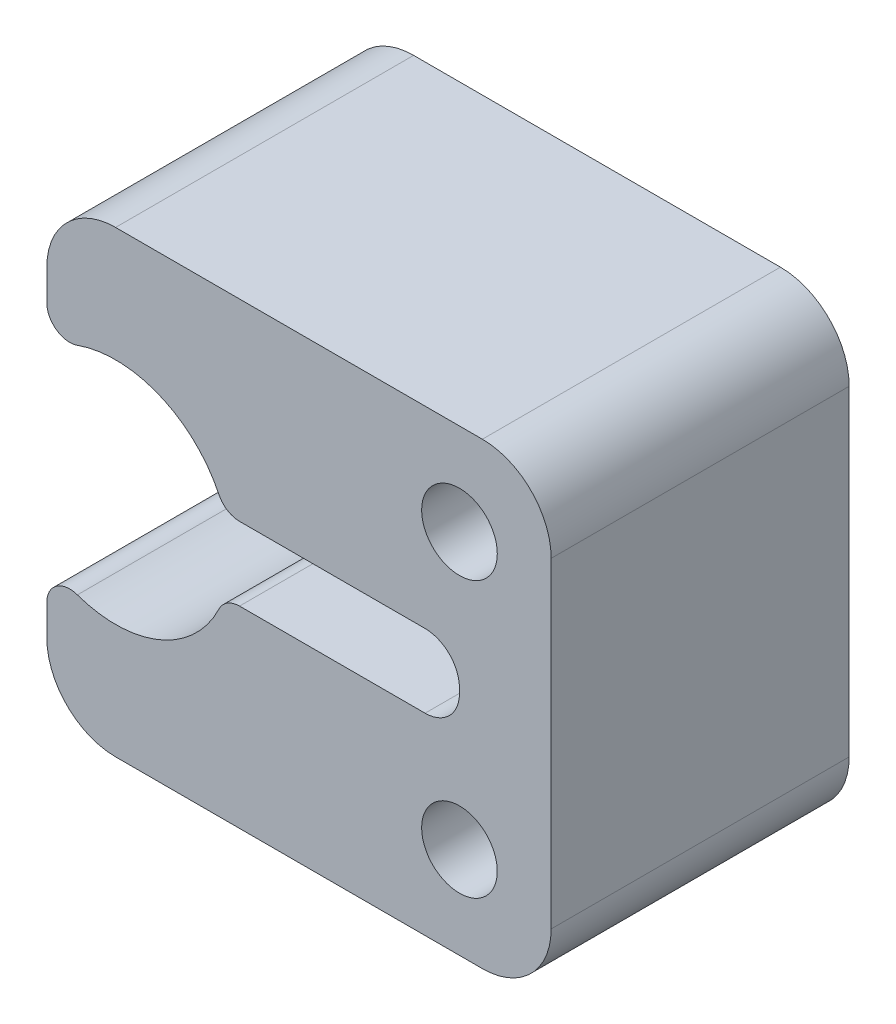
ISO-10303-21;
HEADER;
FILE_DESCRIPTION(('STEP AP214'),'2;1');
FILE_NAME('part.step','',(''),(''),'','','');
FILE_SCHEMA(('AUTOMOTIVE_DESIGN { 1 0 10303 214 1 1 1 1 }'));
ENDSEC;
DATA;
#1=APPLICATION_CONTEXT('core data for automotive mechanical design processes');
#2=APPLICATION_PROTOCOL_DEFINITION('international standard','automotive_design',2000,#1);
#3=PRODUCT_CONTEXT('',#1,'mechanical');
#4=PRODUCT('Part','Part','',(#3));
#5=PRODUCT_RELATED_PRODUCT_CATEGORY('part','',(#4));
#6=PRODUCT_DEFINITION_FORMATION('','',#4);
#7=PRODUCT_DEFINITION_CONTEXT('part definition',#1,'design');
#8=PRODUCT_DEFINITION('design','',#6,#7);
#9=PRODUCT_DEFINITION_SHAPE('','',#8);
#10=(LENGTH_UNIT() NAMED_UNIT(*) SI_UNIT(.MILLI.,.METRE.));
#11=(NAMED_UNIT(*) PLANE_ANGLE_UNIT() SI_UNIT($,.RADIAN.));
#12=(NAMED_UNIT(*) SI_UNIT($,.STERADIAN.) SOLID_ANGLE_UNIT());
#13=UNCERTAINTY_MEASURE_WITH_UNIT(LENGTH_MEASURE(1.E-05),#10,'distance_accuracy_value','');
#14=(GEOMETRIC_REPRESENTATION_CONTEXT(3) GLOBAL_UNCERTAINTY_ASSIGNED_CONTEXT((#13)) GLOBAL_UNIT_ASSIGNED_CONTEXT((#10,
#11,#12)) REPRESENTATION_CONTEXT('',''));
#15=CARTESIAN_POINT('',(0.,0.,0.));
#16=DIRECTION('',(0.,0.,1.));
#17=DIRECTION('',(1.,0.,0.));
#18=AXIS2_PLACEMENT_3D('',#15,#16,#17);
#19=CARTESIAN_POINT('',(3.,10.,0.));
#20=DIRECTION('',(0.,0.,1.));
#21=DIRECTION('',(1.,0.,0.));
#22=AXIS2_PLACEMENT_3D('',#19,#20,#21);
#23=CYLINDRICAL_SURFACE('',#22,5.);
#24=CARTESIAN_POINT('',(3.,10.,13.));
#25=DIRECTION('',(0.,0.,1.));
#26=DIRECTION('',(1.,0.,0.));
#27=AXIS2_PLACEMENT_3D('',#24,#25,#26);
#28=CIRCLE('',#27,5.);
#29=CARTESIAN_POINT('',(1.33333333333333,5.28595479208968,13.));
#30=VERTEX_POINT('',#29);
#31=CARTESIAN_POINT('',(7.50616861153193,7.83333333333333,13.));
#32=VERTEX_POINT('',#31);
#33=EDGE_CURVE('E186',#30,#32,#28,.T.);
#34=ORIENTED_EDGE('',*,*,#33,.T.);
#35=DIRECTION('',(0.,0.,1.));
#36=VECTOR('',#35,1.);
#37=CARTESIAN_POINT('',(7.50616861153193,7.83333333333333,0.));
#38=LINE('',#37,#36);
#39=CARTESIAN_POINT('',(7.50616861153193,7.83333333333333,0.));
#40=VERTEX_POINT('',#39);
#41=EDGE_CURVE('E190',#32,#40,#38,.F.);
#42=ORIENTED_EDGE('',*,*,#41,.T.);
#43=CARTESIAN_POINT('',(3.,10.,0.));
#44=DIRECTION('',(0.,0.,1.));
#45=DIRECTION('',(-1.,0.,0.));
#46=AXIS2_PLACEMENT_3D('',#43,#44,#45);
#47=CIRCLE('',#46,5.);
#48=CARTESIAN_POINT('',(1.33333333333333,5.28595479208968,0.));
#49=VERTEX_POINT('',#48);
#50=EDGE_CURVE('E189',#49,#40,#47,.T.);
#51=ORIENTED_EDGE('',*,*,#50,.F.);
#52=DIRECTION('',(0.,0.,1.));
#53=VECTOR('',#52,1.);
#54=CARTESIAN_POINT('',(1.33333333333333,5.28595479208968,0.));
#55=LINE('',#54,#53);
#56=EDGE_CURVE('E174',#49,#30,#55,.T.);
#57=ORIENTED_EDGE('',*,*,#56,.T.);
#58=EDGE_LOOP('',(#34,#42,#51,#57));
#59=FACE_BOUND('',#58,.T.);
#60=ADVANCED_FACE('F33',(#59),#23,.F.);
#61=CARTESIAN_POINT('',(0.,0.,13.));
#62=DIRECTION('',(1.,0.,0.));
#63=DIRECTION('',(0.,0.,-1.));
#64=AXIS2_PLACEMENT_3D('',#61,#62,#63);
#65=PLANE('',#64);
#66=DIRECTION('',(0.,-1.,0.));
#67=VECTOR('',#66,1.);
#68=CARTESIAN_POINT('',(0.,0.,13.));
#69=LINE('',#68,#67);
#70=CARTESIAN_POINT('',(0.,17.,13.));
#71=VERTEX_POINT('',#70);
#72=CARTESIAN_POINT('',(0.,15.6568542494924,13.));
#73=VERTEX_POINT('',#72);
#74=EDGE_CURVE('E330',#71,#73,#69,.T.);
#75=ORIENTED_EDGE('',*,*,#74,.F.);
#76=DIRECTION('',(0.,0.,-1.));
#77=VECTOR('',#76,1.);
#78=CARTESIAN_POINT('',(0.,17.,13.));
#79=LINE('',#78,#77);
#80=CARTESIAN_POINT('',(0.,17.,0.));
#81=VERTEX_POINT('',#80);
#82=EDGE_CURVE('E268',#71,#81,#79,.T.);
#83=ORIENTED_EDGE('',*,*,#82,.T.);
#84=DIRECTION('',(0.,-1.,0.));
#85=VECTOR('',#84,1.);
#86=CARTESIAN_POINT('',(0.,0.,0.));
#87=LINE('',#86,#85);
#88=CARTESIAN_POINT('',(0.,15.6568542494924,0.));
#89=VERTEX_POINT('',#88);
#90=EDGE_CURVE('E338',#81,#89,#87,.T.);
#91=ORIENTED_EDGE('',*,*,#90,.T.);
#92=DIRECTION('',(0.,0.,1.));
#93=VECTOR('',#92,1.);
#94=CARTESIAN_POINT('',(0.,15.6568542494924,13.));
#95=LINE('',#94,#93);
#96=EDGE_CURVE('E233',#89,#73,#95,.T.);
#97=ORIENTED_EDGE('',*,*,#96,.T.);
#98=EDGE_LOOP('',(#75,#83,#91,#97));
#99=FACE_BOUND('',#98,.T.);
#100=ADVANCED_FACE('F360',(#99),#65,.F.);
#101=CARTESIAN_POINT('',(0.,4.34314575050762,0.));
#102=VERTEX_POINT('',#101);
#103=CARTESIAN_POINT('',(0.,3.,0.));
#104=VERTEX_POINT('',#103);
#105=EDGE_CURVE('E327',#102,#104,#87,.T.);
#106=ORIENTED_EDGE('',*,*,#105,.T.);
#107=DIRECTION('',(0.,0.,-1.));
#108=VECTOR('',#107,1.);
#109=CARTESIAN_POINT('',(0.,3.,13.));
#110=LINE('',#109,#108);
#111=CARTESIAN_POINT('',(0.,3.,13.));
#112=VERTEX_POINT('',#111);
#113=EDGE_CURVE('E271',#104,#112,#110,.F.);
#114=ORIENTED_EDGE('',*,*,#113,.T.);
#115=CARTESIAN_POINT('',(0.,4.34314575050762,13.));
#116=VERTEX_POINT('',#115);
#117=EDGE_CURVE('E328',#116,#112,#69,.T.);
#118=ORIENTED_EDGE('',*,*,#117,.F.);
#119=DIRECTION('',(0.,0.,1.));
#120=VECTOR('',#119,1.);
#121=CARTESIAN_POINT('',(0.,4.34314575050762,13.));
#122=LINE('',#121,#120);
#123=EDGE_CURVE('E175',#116,#102,#122,.F.);
#124=ORIENTED_EDGE('',*,*,#123,.T.);
#125=EDGE_LOOP('',(#106,#114,#118,#124));
#126=FACE_BOUND('',#125,.T.);
#127=ADVANCED_FACE('F389',(#126),#65,.F.);
#128=CARTESIAN_POINT('',(0.,0.,13.));
#129=DIRECTION('',(0.,1.,0.));
#130=DIRECTION('',(0.,0.,1.));
#131=AXIS2_PLACEMENT_3D('',#128,#129,#130);
#132=PLANE('',#131);
#133=DIRECTION('',(1.,0.,0.));
#134=VECTOR('',#133,1.);
#135=CARTESIAN_POINT('',(0.,0.,0.));
#136=LINE('',#135,#134);
#137=CARTESIAN_POINT('',(3.,0.,0.));
#138=VERTEX_POINT('',#137);
#139=CARTESIAN_POINT('',(19.,0.,0.));
#140=VERTEX_POINT('',#139);
#141=EDGE_CURVE('E340',#138,#140,#136,.T.);
#142=ORIENTED_EDGE('',*,*,#141,.T.);
#143=DIRECTION('',(0.,0.,-1.));
#144=VECTOR('',#143,1.);
#145=CARTESIAN_POINT('',(19.,0.,13.));
#146=LINE('',#145,#144);
#147=CARTESIAN_POINT('',(19.,0.,13.));
#148=VERTEX_POINT('',#147);
#149=EDGE_CURVE('E253',#140,#148,#146,.F.);
#150=ORIENTED_EDGE('',*,*,#149,.T.);
#151=DIRECTION('',(1.,0.,0.));
#152=VECTOR('',#151,1.);
#153=CARTESIAN_POINT('',(0.,0.,13.));
#154=LINE('',#153,#152);
#155=CARTESIAN_POINT('',(3.,0.,13.));
#156=VERTEX_POINT('',#155);
#157=EDGE_CURVE('E331',#156,#148,#154,.T.);
#158=ORIENTED_EDGE('',*,*,#157,.F.);
#159=DIRECTION('',(0.,0.,-1.));
#160=VECTOR('',#159,1.);
#161=CARTESIAN_POINT('',(3.,0.,13.));
#162=LINE('',#161,#160);
#163=EDGE_CURVE('E250',#156,#138,#162,.T.);
#164=ORIENTED_EDGE('',*,*,#163,.T.);
#165=EDGE_LOOP('',(#142,#150,#158,#164));
#166=FACE_BOUND('',#165,.T.);
#167=ADVANCED_FACE('F418',(#166),#132,.F.);
#168=CARTESIAN_POINT('',(22.,0.,13.));
#169=DIRECTION('',(-1.,0.,0.));
#170=DIRECTION('',(0.,0.,1.));
#171=AXIS2_PLACEMENT_3D('',#168,#169,#170);
#172=PLANE('',#171);
#173=DIRECTION('',(0.,1.,0.));
#174=VECTOR('',#173,1.);
#175=CARTESIAN_POINT('',(22.,0.,13.));
#176=LINE('',#175,#174);
#177=CARTESIAN_POINT('',(22.,3.,13.));
#178=VERTEX_POINT('',#177);
#179=CARTESIAN_POINT('',(22.,17.,13.));
#180=VERTEX_POINT('',#179);
#181=EDGE_CURVE('E333',#178,#180,#176,.T.);
#182=ORIENTED_EDGE('',*,*,#181,.F.);
#183=DIRECTION('',(0.,0.,-1.));
#184=VECTOR('',#183,1.);
#185=CARTESIAN_POINT('',(22.,3.,13.));
#186=LINE('',#185,#184);
#187=CARTESIAN_POINT('',(22.,3.,0.));
#188=VERTEX_POINT('',#187);
#189=EDGE_CURVE('E239',#178,#188,#186,.T.);
#190=ORIENTED_EDGE('',*,*,#189,.T.);
#191=DIRECTION('',(0.,1.,0.));
#192=VECTOR('',#191,1.);
#193=CARTESIAN_POINT('',(22.,0.,0.));
#194=LINE('',#193,#192);
#195=CARTESIAN_POINT('',(22.,17.,0.));
#196=VERTEX_POINT('',#195);
#197=EDGE_CURVE('E342',#188,#196,#194,.T.);
#198=ORIENTED_EDGE('',*,*,#197,.T.);
#199=DIRECTION('',(0.,0.,-1.));
#200=VECTOR('',#199,1.);
#201=CARTESIAN_POINT('',(22.,17.,13.));
#202=LINE('',#201,#200);
#203=EDGE_CURVE('E237',#196,#180,#202,.F.);
#204=ORIENTED_EDGE('',*,*,#203,.T.);
#205=EDGE_LOOP('',(#182,#190,#198,#204));
#206=FACE_BOUND('',#205,.T.);
#207=ADVANCED_FACE('F415',(#206),#172,.F.);
#208=CARTESIAN_POINT('',(0.,20.,13.));
#209=DIRECTION('',(0.,-1.,0.));
#210=DIRECTION('',(0.,0.,-1.));
#211=AXIS2_PLACEMENT_3D('',#208,#209,#210);
#212=PLANE('',#211);
#213=DIRECTION('',(-1.,0.,0.));
#214=VECTOR('',#213,1.);
#215=CARTESIAN_POINT('',(0.,20.,13.));
#216=LINE('',#215,#214);
#217=CARTESIAN_POINT('',(19.,20.,13.));
#218=VERTEX_POINT('',#217);
#219=CARTESIAN_POINT('',(3.,20.,13.));
#220=VERTEX_POINT('',#219);
#221=EDGE_CURVE('E191',#218,#220,#216,.T.);
#222=ORIENTED_EDGE('',*,*,#221,.F.);
#223=DIRECTION('',(0.,0.,-1.));
#224=VECTOR('',#223,1.);
#225=CARTESIAN_POINT('',(19.,20.,13.));
#226=LINE('',#225,#224);
#227=CARTESIAN_POINT('',(19.,20.,0.));
#228=VERTEX_POINT('',#227);
#229=EDGE_CURVE('E265',#218,#228,#226,.T.);
#230=ORIENTED_EDGE('',*,*,#229,.T.);
#231=DIRECTION('',(-1.,0.,0.));
#232=VECTOR('',#231,1.);
#233=CARTESIAN_POINT('',(0.,20.,0.));
#234=LINE('',#233,#232);
#235=CARTESIAN_POINT('',(3.,20.,0.));
#236=VERTEX_POINT('',#235);
#237=EDGE_CURVE('E206',#228,#236,#234,.T.);
#238=ORIENTED_EDGE('',*,*,#237,.T.);
#239=DIRECTION('',(0.,0.,-1.));
#240=VECTOR('',#239,1.);
#241=CARTESIAN_POINT('',(3.,20.,13.));
#242=LINE('',#241,#240);
#243=EDGE_CURVE('E263',#236,#220,#242,.F.);
#244=ORIENTED_EDGE('',*,*,#243,.T.);
#245=EDGE_LOOP('',(#222,#230,#238,#244));
#246=FACE_BOUND('',#245,.T.);
#247=ADVANCED_FACE('F351',(#246),#212,.F.);
#248=CARTESIAN_POINT('',(0.,0.,13.));
#249=DIRECTION('',(0.,0.,-1.));
#250=DIRECTION('',(-1.,0.,0.));
#251=AXIS2_PLACEMENT_3D('',#248,#249,#250);
#252=PLANE('',#251);
#253=CARTESIAN_POINT('',(18.,4.,13.));
#254=DIRECTION('',(0.,0.,-1.));
#255=DIRECTION('',(-1.,0.,0.));
#256=AXIS2_PLACEMENT_3D('',#253,#254,#255);
#257=CIRCLE('',#256,1.65);
#258=CARTESIAN_POINT('',(16.35,4.,13.));
#259=VERTEX_POINT('',#258);
#260=EDGE_CURVE('E197',#259,#259,#257,.T.);
#261=ORIENTED_EDGE('',*,*,#260,.T.);
#262=EDGE_LOOP('',(#261));
#263=FACE_BOUND('',#262,.T.);
#264=CARTESIAN_POINT('',(18.,16.,13.));
#265=DIRECTION('',(0.,0.,-1.));
#266=DIRECTION('',(-1.,0.,0.));
#267=AXIS2_PLACEMENT_3D('',#264,#265,#266);
#268=CIRCLE('',#267,1.65);
#269=CARTESIAN_POINT('',(16.35,16.,13.));
#270=VERTEX_POINT('',#269);
#271=EDGE_CURVE('E324',#270,#270,#268,.T.);
#272=ORIENTED_EDGE('',*,*,#271,.T.);
#273=EDGE_LOOP('',(#272));
#274=FACE_BOUND('',#273,.T.);
#275=ORIENTED_EDGE('',*,*,#157,.T.);
#276=CARTESIAN_POINT('',(19.,3.,13.));
#277=DIRECTION('',(0.,0.,-1.));
#278=DIRECTION('',(-1.,0.,0.));
#279=AXIS2_PLACEMENT_3D('',#276,#277,#278);
#280=CIRCLE('',#279,3.);
#281=EDGE_CURVE('E261',#148,#178,#280,.F.);
#282=ORIENTED_EDGE('',*,*,#281,.T.);
#283=ORIENTED_EDGE('',*,*,#181,.T.);
#284=CARTESIAN_POINT('',(19.,17.,13.));
#285=DIRECTION('',(0.,0.,-1.));
#286=DIRECTION('',(-1.,0.,0.));
#287=AXIS2_PLACEMENT_3D('',#284,#285,#286);
#288=CIRCLE('',#287,3.);
#289=EDGE_CURVE('E259',#180,#218,#288,.F.);
#290=ORIENTED_EDGE('',*,*,#289,.T.);
#291=ORIENTED_EDGE('',*,*,#221,.T.);
#292=CARTESIAN_POINT('',(3.,17.,13.));
#293=DIRECTION('',(0.,0.,-1.));
#294=DIRECTION('',(-1.,0.,0.));
#295=AXIS2_PLACEMENT_3D('',#292,#293,#294);
#296=CIRCLE('',#295,3.);
#297=EDGE_CURVE('E257',#220,#71,#296,.F.);
#298=ORIENTED_EDGE('',*,*,#297,.T.);
#299=ORIENTED_EDGE('',*,*,#74,.T.);
#300=CARTESIAN_POINT('',(1.,15.6568542494924,13.));
#301=DIRECTION('',(0.,0.,-1.));
#302=DIRECTION('',(-1.,0.,0.));
#303=AXIS2_PLACEMENT_3D('',#300,#301,#302);
#304=CIRCLE('',#303,1.);
#305=CARTESIAN_POINT('',(1.33333333333333,14.7140452079103,13.));
#306=VERTEX_POINT('',#305);
#307=EDGE_CURVE('E179',#73,#306,#304,.F.);
#308=ORIENTED_EDGE('',*,*,#307,.T.);
#309=CARTESIAN_POINT('',(7.50616861153192,12.1666666666667,13.));
#310=VERTEX_POINT('',#309);
#311=EDGE_CURVE('E198',#310,#306,#28,.T.);
#312=ORIENTED_EDGE('',*,*,#311,.F.);
#313=CARTESIAN_POINT('',(8.40740233383831,12.6,13.));
#314=DIRECTION('',(0.,0.,-1.));
#315=DIRECTION('',(-1.,0.,0.));
#316=AXIS2_PLACEMENT_3D('',#313,#314,#315);
#317=CIRCLE('',#316,1.);
#318=CARTESIAN_POINT('',(8.40740233383831,11.6,13.));
#319=VERTEX_POINT('',#318);
#320=EDGE_CURVE('E221',#310,#319,#317,.F.);
#321=ORIENTED_EDGE('',*,*,#320,.T.);
#322=DIRECTION('',(-1.,0.,0.));
#323=VECTOR('',#322,1.);
#324=CARTESIAN_POINT('',(5.99999999999999,11.6,13.));
#325=LINE('',#324,#323);
#326=CARTESIAN_POINT('',(16.5,11.6,13.));
#327=VERTEX_POINT('',#326);
#328=EDGE_CURVE('E308',#327,#319,#325,.T.);
#329=ORIENTED_EDGE('',*,*,#328,.F.);
#330=CARTESIAN_POINT('',(16.5,10.1,13.));
#331=DIRECTION('',(0.,0.,-1.));
#332=DIRECTION('',(-1.,0.,0.));
#333=AXIS2_PLACEMENT_3D('',#330,#331,#332);
#334=CIRCLE('',#333,1.5);
#335=CARTESIAN_POINT('',(18.,10.1,13.));
#336=VERTEX_POINT('',#335);
#337=EDGE_CURVE('E282',#327,#336,#334,.T.);
#338=ORIENTED_EDGE('',*,*,#337,.T.);
#339=DIRECTION('',(0.,1.,0.));
#340=VECTOR('',#339,1.);
#341=CARTESIAN_POINT('',(18.,11.6,13.));
#342=LINE('',#341,#340);
#343=CARTESIAN_POINT('',(18.,9.9,13.));
#344=VERTEX_POINT('',#343);
#345=EDGE_CURVE('E307',#344,#336,#342,.T.);
#346=ORIENTED_EDGE('',*,*,#345,.F.);
#347=CARTESIAN_POINT('',(16.5,9.9,13.));
#348=DIRECTION('',(0.,0.,-1.));
#349=DIRECTION('',(-1.,0.,0.));
#350=AXIS2_PLACEMENT_3D('',#347,#348,#349);
#351=CIRCLE('',#350,1.5);
#352=CARTESIAN_POINT('',(16.5,8.4,13.));
#353=VERTEX_POINT('',#352);
#354=EDGE_CURVE('E41',#344,#353,#351,.T.);
#355=ORIENTED_EDGE('',*,*,#354,.T.);
#356=DIRECTION('',(1.,0.,0.));
#357=VECTOR('',#356,1.);
#358=CARTESIAN_POINT('',(5.99999999999999,8.4,13.));
#359=LINE('',#358,#357);
#360=CARTESIAN_POINT('',(8.40740233383831,8.4,13.));
#361=VERTEX_POINT('',#360);
#362=EDGE_CURVE('E312',#361,#353,#359,.T.);
#363=ORIENTED_EDGE('',*,*,#362,.F.);
#364=CARTESIAN_POINT('',(8.40740233383831,7.4,13.));
#365=DIRECTION('',(0.,0.,-1.));
#366=DIRECTION('',(-1.,0.,0.));
#367=AXIS2_PLACEMENT_3D('',#364,#365,#366);
#368=CIRCLE('',#367,1.);
#369=EDGE_CURVE('E196',#361,#32,#368,.F.);
#370=ORIENTED_EDGE('',*,*,#369,.T.);
#371=ORIENTED_EDGE('',*,*,#33,.F.);
#372=CARTESIAN_POINT('',(1.,4.34314575050762,13.));
#373=DIRECTION('',(0.,0.,-1.));
#374=DIRECTION('',(-1.,0.,0.));
#375=AXIS2_PLACEMENT_3D('',#372,#373,#374);
#376=CIRCLE('',#375,1.);
#377=EDGE_CURVE('E170',#30,#116,#376,.F.);
#378=ORIENTED_EDGE('',*,*,#377,.T.);
#379=ORIENTED_EDGE('',*,*,#117,.T.);
#380=CARTESIAN_POINT('',(3.,3.,13.));
#381=DIRECTION('',(0.,0.,-1.));
#382=DIRECTION('',(-1.,0.,0.));
#383=AXIS2_PLACEMENT_3D('',#380,#381,#382);
#384=CIRCLE('',#383,3.);
#385=EDGE_CURVE('E255',#112,#156,#384,.F.);
#386=ORIENTED_EDGE('',*,*,#385,.T.);
#387=EDGE_LOOP('',(#275,#282,#283,#290,#291,#298,#299,#308,#312,#321,#329,#338,#346,#355,#363,
#370,#371,#378,#379,#386));
#388=FACE_BOUND('',#387,.T.);
#389=ADVANCED_FACE('F194',(#263,#274,#388),#252,.F.);
#390=CARTESIAN_POINT('',(0.,0.,0.));
#391=DIRECTION('',(0.,0.,-1.));
#392=DIRECTION('',(-1.,0.,0.));
#393=AXIS2_PLACEMENT_3D('',#390,#391,#392);
#394=PLANE('',#393);
#395=ORIENTED_EDGE('',*,*,#197,.F.);
#396=CARTESIAN_POINT('',(19.,3.,0.));
#397=DIRECTION('',(0.,0.,-1.));
#398=DIRECTION('',(-1.,0.,0.));
#399=AXIS2_PLACEMENT_3D('',#396,#397,#398);
#400=CIRCLE('',#399,3.);
#401=EDGE_CURVE('E248',#188,#140,#400,.T.);
#402=ORIENTED_EDGE('',*,*,#401,.T.);
#403=ORIENTED_EDGE('',*,*,#141,.F.);
#404=CARTESIAN_POINT('',(3.,3.,0.));
#405=DIRECTION('',(0.,0.,-1.));
#406=DIRECTION('',(-1.,0.,0.));
#407=AXIS2_PLACEMENT_3D('',#404,#405,#406);
#408=CIRCLE('',#407,3.);
#409=EDGE_CURVE('E242',#138,#104,#408,.T.);
#410=ORIENTED_EDGE('',*,*,#409,.T.);
#411=ORIENTED_EDGE('',*,*,#105,.F.);
#412=CARTESIAN_POINT('',(1.,4.34314575050762,0.));
#413=DIRECTION('',(0.,0.,-1.));
#414=DIRECTION('',(-1.,0.,0.));
#415=AXIS2_PLACEMENT_3D('',#412,#413,#414);
#416=CIRCLE('',#415,1.);
#417=EDGE_CURVE('E210',#102,#49,#416,.T.);
#418=ORIENTED_EDGE('',*,*,#417,.T.);
#419=ORIENTED_EDGE('',*,*,#50,.T.);
#420=CARTESIAN_POINT('',(8.40740233383831,7.4,0.));
#421=DIRECTION('',(0.,0.,-1.));
#422=DIRECTION('',(-1.,0.,0.));
#423=AXIS2_PLACEMENT_3D('',#420,#421,#422);
#424=CIRCLE('',#423,1.);
#425=CARTESIAN_POINT('',(8.40740233383831,8.4,0.));
#426=VERTEX_POINT('',#425);
#427=EDGE_CURVE('E217',#40,#426,#424,.T.);
#428=ORIENTED_EDGE('',*,*,#427,.T.);
#429=DIRECTION('',(1.,0.,0.));
#430=VECTOR('',#429,1.);
#431=CARTESIAN_POINT('',(5.99999999999999,8.4,0.));
#432=LINE('',#431,#430);
#433=CARTESIAN_POINT('',(16.5,8.4,0.));
#434=VERTEX_POINT('',#433);
#435=EDGE_CURVE('E314',#426,#434,#432,.T.);
#436=ORIENTED_EDGE('',*,*,#435,.T.);
#437=CARTESIAN_POINT('',(16.5,9.9,0.));
#438=DIRECTION('',(0.,0.,-1.));
#439=DIRECTION('',(-1.,0.,0.));
#440=AXIS2_PLACEMENT_3D('',#437,#438,#439);
#441=CIRCLE('',#440,1.5);
#442=CARTESIAN_POINT('',(18.,9.9,0.));
#443=VERTEX_POINT('',#442);
#444=EDGE_CURVE('E11',#434,#443,#441,.F.);
#445=ORIENTED_EDGE('',*,*,#444,.T.);
#446=DIRECTION('',(0.,1.,0.));
#447=VECTOR('',#446,1.);
#448=CARTESIAN_POINT('',(18.,11.6,0.));
#449=LINE('',#448,#447);
#450=CARTESIAN_POINT('',(18.,10.1,0.));
#451=VERTEX_POINT('',#450);
#452=EDGE_CURVE('E294',#443,#451,#449,.T.);
#453=ORIENTED_EDGE('',*,*,#452,.T.);
#454=CARTESIAN_POINT('',(16.5,10.1,0.));
#455=DIRECTION('',(0.,0.,-1.));
#456=DIRECTION('',(-1.,0.,0.));
#457=AXIS2_PLACEMENT_3D('',#454,#455,#456);
#458=CIRCLE('',#457,1.5);
#459=CARTESIAN_POINT('',(16.5,11.6,0.));
#460=VERTEX_POINT('',#459);
#461=EDGE_CURVE('E284',#451,#460,#458,.F.);
#462=ORIENTED_EDGE('',*,*,#461,.T.);
#463=DIRECTION('',(-1.,0.,0.));
#464=VECTOR('',#463,1.);
#465=CARTESIAN_POINT('',(5.99999999999999,11.6,0.));
#466=LINE('',#465,#464);
#467=CARTESIAN_POINT('',(8.40740233383831,11.6,0.));
#468=VERTEX_POINT('',#467);
#469=EDGE_CURVE('E292',#460,#468,#466,.T.);
#470=ORIENTED_EDGE('',*,*,#469,.T.);
#471=CARTESIAN_POINT('',(8.40740233383831,12.6,0.));
#472=DIRECTION('',(0.,0.,-1.));
#473=DIRECTION('',(-1.,0.,0.));
#474=AXIS2_PLACEMENT_3D('',#471,#472,#473);
#475=CIRCLE('',#474,1.);
#476=CARTESIAN_POINT('',(7.50616861153192,12.1666666666667,0.));
#477=VERTEX_POINT('',#476);
#478=EDGE_CURVE('E215',#468,#477,#475,.T.);
#479=ORIENTED_EDGE('',*,*,#478,.T.);
#480=CARTESIAN_POINT('',(1.33333333333333,14.7140452079103,0.));
#481=VERTEX_POINT('',#480);
#482=EDGE_CURVE('E303',#477,#481,#47,.T.);
#483=ORIENTED_EDGE('',*,*,#482,.T.);
#484=CARTESIAN_POINT('',(1.,15.6568542494924,0.));
#485=DIRECTION('',(0.,0.,-1.));
#486=DIRECTION('',(-1.,0.,0.));
#487=AXIS2_PLACEMENT_3D('',#484,#485,#486);
#488=CIRCLE('',#487,1.);
#489=EDGE_CURVE('E212',#481,#89,#488,.T.);
#490=ORIENTED_EDGE('',*,*,#489,.T.);
#491=ORIENTED_EDGE('',*,*,#90,.F.);
#492=CARTESIAN_POINT('',(3.,17.,0.));
#493=DIRECTION('',(0.,0.,-1.));
#494=DIRECTION('',(-1.,0.,0.));
#495=AXIS2_PLACEMENT_3D('',#492,#493,#494);
#496=CIRCLE('',#495,3.);
#497=EDGE_CURVE('E244',#81,#236,#496,.T.);
#498=ORIENTED_EDGE('',*,*,#497,.T.);
#499=ORIENTED_EDGE('',*,*,#237,.F.);
#500=CARTESIAN_POINT('',(19.,17.,0.));
#501=DIRECTION('',(0.,0.,-1.));
#502=DIRECTION('',(-1.,0.,0.));
#503=AXIS2_PLACEMENT_3D('',#500,#501,#502);
#504=CIRCLE('',#503,3.);
#505=EDGE_CURVE('E246',#228,#196,#504,.T.);
#506=ORIENTED_EDGE('',*,*,#505,.T.);
#507=EDGE_LOOP('',(#395,#402,#403,#410,#411,#418,#419,#428,#436,#445,#453,#462,#470,#479,#483,
#490,#491,#498,#499,#506));
#508=FACE_BOUND('',#507,.T.);
#509=CARTESIAN_POINT('',(18.,4.,0.));
#510=DIRECTION('',(0.,0.,1.));
#511=DIRECTION('',(-1.,0.,0.));
#512=AXIS2_PLACEMENT_3D('',#509,#510,#511);
#513=CIRCLE('',#512,1.65);
#514=CARTESIAN_POINT('',(16.35,4.,0.));
#515=VERTEX_POINT('',#514);
#516=EDGE_CURVE('E204',#515,#515,#513,.T.);
#517=ORIENTED_EDGE('',*,*,#516,.T.);
#518=EDGE_LOOP('',(#517));
#519=FACE_BOUND('',#518,.T.);
#520=CARTESIAN_POINT('',(18.,16.,0.));
#521=DIRECTION('',(0.,0.,1.));
#522=DIRECTION('',(1.,0.,0.));
#523=AXIS2_PLACEMENT_3D('',#520,#521,#522);
#524=CIRCLE('',#523,1.65);
#525=CARTESIAN_POINT('',(19.65,16.,0.));
#526=VERTEX_POINT('',#525);
#527=EDGE_CURVE('E201',#526,#526,#524,.T.);
#528=ORIENTED_EDGE('',*,*,#527,.T.);
#529=EDGE_LOOP('',(#528));
#530=FACE_BOUND('',#529,.T.);
#531=ADVANCED_FACE('F290',(#508,#519,#530),#394,.T.);
#532=CARTESIAN_POINT('',(18.,16.,0.));
#533=DIRECTION('',(0.,0.,1.));
#534=DIRECTION('',(1.,0.,0.));
#535=AXIS2_PLACEMENT_3D('',#532,#533,#534);
#536=CYLINDRICAL_SURFACE('',#535,1.65);
#537=ORIENTED_EDGE('',*,*,#527,.F.);
#538=EDGE_LOOP('',(#537));
#539=FACE_BOUND('',#538,.T.);
#540=ORIENTED_EDGE('',*,*,#271,.F.);
#541=EDGE_LOOP('',(#540));
#542=FACE_BOUND('',#541,.T.);
#543=ADVANCED_FACE('F395',(#539,#542),#536,.F.);
#544=ORIENTED_EDGE('',*,*,#482,.F.);
#545=DIRECTION('',(0.,0.,1.));
#546=VECTOR('',#545,1.);
#547=CARTESIAN_POINT('',(7.50616861153192,12.1666666666667,0.));
#548=LINE('',#547,#546);
#549=EDGE_CURVE('E227',#477,#310,#548,.T.);
#550=ORIENTED_EDGE('',*,*,#549,.T.);
#551=ORIENTED_EDGE('',*,*,#311,.T.);
#552=DIRECTION('',(0.,0.,1.));
#553=VECTOR('',#552,1.);
#554=CARTESIAN_POINT('',(1.33333333333333,14.7140452079103,0.));
#555=LINE('',#554,#553);
#556=EDGE_CURVE('E225',#306,#481,#555,.F.);
#557=ORIENTED_EDGE('',*,*,#556,.T.);
#558=EDGE_LOOP('',(#544,#550,#551,#557));
#559=FACE_BOUND('',#558,.T.);
#560=ADVANCED_FACE('F370',(#559),#23,.F.);
#561=CARTESIAN_POINT('',(18.,4.,0.));
#562=DIRECTION('',(0.,0.,1.));
#563=DIRECTION('',(1.,0.,0.));
#564=AXIS2_PLACEMENT_3D('',#561,#562,#563);
#565=CYLINDRICAL_SURFACE('',#564,1.65);
#566=ORIENTED_EDGE('',*,*,#516,.F.);
#567=EDGE_LOOP('',(#566));
#568=FACE_BOUND('',#567,.T.);
#569=ORIENTED_EDGE('',*,*,#260,.F.);
#570=EDGE_LOOP('',(#569));
#571=FACE_BOUND('',#570,.T.);
#572=ADVANCED_FACE('F394',(#568,#571),#565,.F.);
#573=CARTESIAN_POINT('',(5.99999999999999,8.4,0.));
#574=DIRECTION('',(0.,-1.,0.));
#575=DIRECTION('',(1.,0.,0.));
#576=AXIS2_PLACEMENT_3D('',#573,#574,#575);
#577=PLANE('',#576);
#578=ORIENTED_EDGE('',*,*,#362,.T.);
#579=DIRECTION('',(0.,0.,1.));
#580=VECTOR('',#579,1.);
#581=CARTESIAN_POINT('',(16.5,8.4,0.));
#582=LINE('',#581,#580);
#583=EDGE_CURVE('E54',#353,#434,#582,.F.);
#584=ORIENTED_EDGE('',*,*,#583,.T.);
#585=ORIENTED_EDGE('',*,*,#435,.F.);
#586=DIRECTION('',(0.,0.,1.));
#587=VECTOR('',#586,1.);
#588=CARTESIAN_POINT('',(8.40740233383831,8.4,0.));
#589=LINE('',#588,#587);
#590=EDGE_CURVE('E180',#426,#361,#589,.T.);
#591=ORIENTED_EDGE('',*,*,#590,.T.);
#592=EDGE_LOOP('',(#578,#584,#585,#591));
#593=FACE_BOUND('',#592,.T.);
#594=ADVANCED_FACE('F400',(#593),#577,.F.);
#595=CARTESIAN_POINT('',(5.99999999999999,11.6,0.));
#596=DIRECTION('',(0.,1.,0.));
#597=DIRECTION('',(0.,0.,1.));
#598=AXIS2_PLACEMENT_3D('',#595,#596,#597);
#599=PLANE('',#598);
#600=ORIENTED_EDGE('',*,*,#469,.F.);
#601=DIRECTION('',(0.,0.,1.));
#602=VECTOR('',#601,1.);
#603=CARTESIAN_POINT('',(16.5,11.6,13.));
#604=LINE('',#603,#602);
#605=EDGE_CURVE('E273',#460,#327,#604,.T.);
#606=ORIENTED_EDGE('',*,*,#605,.T.);
#607=ORIENTED_EDGE('',*,*,#328,.T.);
#608=DIRECTION('',(0.,0.,1.));
#609=VECTOR('',#608,1.);
#610=CARTESIAN_POINT('',(8.40740233383831,11.6,0.));
#611=LINE('',#610,#609);
#612=EDGE_CURVE('E230',#319,#468,#611,.F.);
#613=ORIENTED_EDGE('',*,*,#612,.T.);
#614=EDGE_LOOP('',(#600,#606,#607,#613));
#615=FACE_BOUND('',#614,.T.);
#616=ADVANCED_FACE('F299',(#615),#599,.F.);
#617=CARTESIAN_POINT('',(18.,11.6,0.));
#618=DIRECTION('',(1.,0.,0.));
#619=DIRECTION('',(0.,0.,-1.));
#620=AXIS2_PLACEMENT_3D('',#617,#618,#619);
#621=PLANE('',#620);
#622=ORIENTED_EDGE('',*,*,#345,.T.);
#623=DIRECTION('',(0.,0.,1.));
#624=VECTOR('',#623,1.);
#625=CARTESIAN_POINT('',(18.,10.1,0.));
#626=LINE('',#625,#624);
#627=EDGE_CURVE('E279',#336,#451,#626,.F.);
#628=ORIENTED_EDGE('',*,*,#627,.T.);
#629=ORIENTED_EDGE('',*,*,#452,.F.);
#630=DIRECTION('',(0.,0.,1.));
#631=VECTOR('',#630,1.);
#632=CARTESIAN_POINT('',(18.,9.9,13.));
#633=LINE('',#632,#631);
#634=EDGE_CURVE('E276',#443,#344,#633,.T.);
#635=ORIENTED_EDGE('',*,*,#634,.T.);
#636=EDGE_LOOP('',(#622,#628,#629,#635));
#637=FACE_BOUND('',#636,.T.);
#638=ADVANCED_FACE('F310',(#637),#621,.F.);
#639=CARTESIAN_POINT('',(8.40740233383831,7.4,0.));
#640=DIRECTION('',(0.,0.,1.));
#641=DIRECTION('',(1.,0.,0.));
#642=AXIS2_PLACEMENT_3D('',#639,#640,#641);
#643=CYLINDRICAL_SURFACE('',#642,1.);
#644=ORIENTED_EDGE('',*,*,#369,.F.);
#645=ORIENTED_EDGE('',*,*,#590,.F.);
#646=ORIENTED_EDGE('',*,*,#427,.F.);
#647=ORIENTED_EDGE('',*,*,#41,.F.);
#648=EDGE_LOOP('',(#644,#645,#646,#647));
#649=FACE_BOUND('',#648,.T.);
#650=ADVANCED_FACE('F375',(#649),#643,.T.);
#651=CARTESIAN_POINT('',(8.40740233383831,12.6,0.));
#652=DIRECTION('',(0.,0.,1.));
#653=DIRECTION('',(1.,0.,0.));
#654=AXIS2_PLACEMENT_3D('',#651,#652,#653);
#655=CYLINDRICAL_SURFACE('',#654,1.);
#656=ORIENTED_EDGE('',*,*,#478,.F.);
#657=ORIENTED_EDGE('',*,*,#612,.F.);
#658=ORIENTED_EDGE('',*,*,#320,.F.);
#659=ORIENTED_EDGE('',*,*,#549,.F.);
#660=EDGE_LOOP('',(#656,#657,#658,#659));
#661=FACE_BOUND('',#660,.T.);
#662=ADVANCED_FACE('F373',(#661),#655,.T.);
#663=CARTESIAN_POINT('',(1.,15.6568542494924,0.));
#664=DIRECTION('',(0.,0.,1.));
#665=DIRECTION('',(1.,0.,0.));
#666=AXIS2_PLACEMENT_3D('',#663,#664,#665);
#667=CYLINDRICAL_SURFACE('',#666,1.);
#668=ORIENTED_EDGE('',*,*,#489,.F.);
#669=ORIENTED_EDGE('',*,*,#556,.F.);
#670=ORIENTED_EDGE('',*,*,#307,.F.);
#671=ORIENTED_EDGE('',*,*,#96,.F.);
#672=EDGE_LOOP('',(#668,#669,#670,#671));
#673=FACE_BOUND('',#672,.T.);
#674=ADVANCED_FACE('F365',(#673),#667,.T.);
#675=CARTESIAN_POINT('',(1.,4.34314575050762,0.));
#676=DIRECTION('',(0.,0.,1.));
#677=DIRECTION('',(1.,0.,0.));
#678=AXIS2_PLACEMENT_3D('',#675,#676,#677);
#679=CYLINDRICAL_SURFACE('',#678,1.);
#680=ORIENTED_EDGE('',*,*,#417,.F.);
#681=ORIENTED_EDGE('',*,*,#123,.F.);
#682=ORIENTED_EDGE('',*,*,#377,.F.);
#683=ORIENTED_EDGE('',*,*,#56,.F.);
#684=EDGE_LOOP('',(#680,#681,#682,#683));
#685=FACE_BOUND('',#684,.T.);
#686=ADVANCED_FACE('F173',(#685),#679,.T.);
#687=CARTESIAN_POINT('',(19.,3.,13.));
#688=DIRECTION('',(0.,0.,-1.));
#689=DIRECTION('',(-1.,0.,0.));
#690=AXIS2_PLACEMENT_3D('',#687,#688,#689);
#691=CYLINDRICAL_SURFACE('',#690,3.);
#692=ORIENTED_EDGE('',*,*,#281,.F.);
#693=ORIENTED_EDGE('',*,*,#149,.F.);
#694=ORIENTED_EDGE('',*,*,#401,.F.);
#695=ORIENTED_EDGE('',*,*,#189,.F.);
#696=EDGE_LOOP('',(#692,#693,#694,#695));
#697=FACE_BOUND('',#696,.T.);
#698=ADVANCED_FACE('F437',(#697),#691,.T.);
#699=CARTESIAN_POINT('',(19.,17.,13.));
#700=DIRECTION('',(0.,0.,-1.));
#701=DIRECTION('',(-1.,0.,0.));
#702=AXIS2_PLACEMENT_3D('',#699,#700,#701);
#703=CYLINDRICAL_SURFACE('',#702,3.);
#704=ORIENTED_EDGE('',*,*,#289,.F.);
#705=ORIENTED_EDGE('',*,*,#203,.F.);
#706=ORIENTED_EDGE('',*,*,#505,.F.);
#707=ORIENTED_EDGE('',*,*,#229,.F.);
#708=EDGE_LOOP('',(#704,#705,#706,#707));
#709=FACE_BOUND('',#708,.T.);
#710=ADVANCED_FACE('F442',(#709),#703,.T.);
#711=CARTESIAN_POINT('',(3.,17.,13.));
#712=DIRECTION('',(0.,0.,-1.));
#713=DIRECTION('',(-1.,0.,0.));
#714=AXIS2_PLACEMENT_3D('',#711,#712,#713);
#715=CYLINDRICAL_SURFACE('',#714,3.);
#716=ORIENTED_EDGE('',*,*,#297,.F.);
#717=ORIENTED_EDGE('',*,*,#243,.F.);
#718=ORIENTED_EDGE('',*,*,#497,.F.);
#719=ORIENTED_EDGE('',*,*,#82,.F.);
#720=EDGE_LOOP('',(#716,#717,#718,#719));
#721=FACE_BOUND('',#720,.T.);
#722=ADVANCED_FACE('F355',(#721),#715,.T.);
#723=CARTESIAN_POINT('',(3.,3.,13.));
#724=DIRECTION('',(0.,0.,-1.));
#725=DIRECTION('',(-1.,0.,0.));
#726=AXIS2_PLACEMENT_3D('',#723,#724,#725);
#727=CYLINDRICAL_SURFACE('',#726,3.);
#728=ORIENTED_EDGE('',*,*,#385,.F.);
#729=ORIENTED_EDGE('',*,*,#113,.F.);
#730=ORIENTED_EDGE('',*,*,#409,.F.);
#731=ORIENTED_EDGE('',*,*,#163,.F.);
#732=EDGE_LOOP('',(#728,#729,#730,#731));
#733=FACE_BOUND('',#732,.T.);
#734=ADVANCED_FACE('F430',(#733),#727,.T.);
#735=CARTESIAN_POINT('',(16.5,10.1,0.));
#736=DIRECTION('',(0.,0.,-1.));
#737=DIRECTION('',(-1.,0.,0.));
#738=AXIS2_PLACEMENT_3D('',#735,#736,#737);
#739=CYLINDRICAL_SURFACE('',#738,1.5);
#740=ORIENTED_EDGE('',*,*,#461,.F.);
#741=ORIENTED_EDGE('',*,*,#627,.F.);
#742=ORIENTED_EDGE('',*,*,#337,.F.);
#743=ORIENTED_EDGE('',*,*,#605,.F.);
#744=EDGE_LOOP('',(#740,#741,#742,#743));
#745=FACE_BOUND('',#744,.T.);
#746=ADVANCED_FACE('F305',(#745),#739,.F.);
#747=CARTESIAN_POINT('',(16.5,9.9,0.));
#748=DIRECTION('',(0.,0.,-1.));
#749=DIRECTION('',(-1.,0.,0.));
#750=AXIS2_PLACEMENT_3D('',#747,#748,#749);
#751=CYLINDRICAL_SURFACE('',#750,1.5);
#752=ORIENTED_EDGE('',*,*,#444,.F.);
#753=ORIENTED_EDGE('',*,*,#583,.F.);
#754=ORIENTED_EDGE('',*,*,#354,.F.);
#755=ORIENTED_EDGE('',*,*,#634,.F.);
#756=EDGE_LOOP('',(#752,#753,#754,#755));
#757=FACE_BOUND('',#756,.T.);
#758=ADVANCED_FACE('F35',(#757),#751,.F.);
#759=CLOSED_SHELL('',(#60,#100,#127,#167,#207,#247,#389,#531,#543,#560,#572,#594,#616,#638,#650,
#662,#674,#686,#698,#710,#722,#734,#746,#758));
#760=MANIFOLD_SOLID_BREP('B2',#759);
#761=ADVANCED_BREP_SHAPE_REPRESENTATION('',(#18,#760),#14);
#762=SHAPE_DEFINITION_REPRESENTATION(#9,#761);
ENDSEC;
END-ISO-10303-21;
